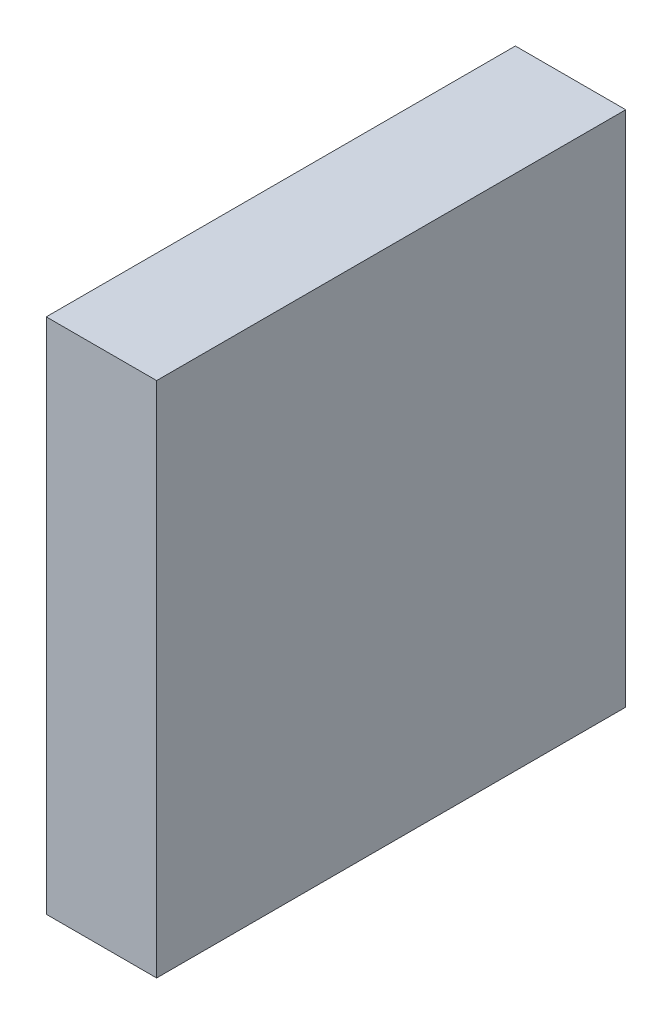
ISO-10303-21;
HEADER;
FILE_DESCRIPTION(('STEP AP214'),'2;1');
FILE_NAME('part.step','',(''),(''),'','','');
FILE_SCHEMA(('AUTOMOTIVE_DESIGN { 1 0 10303 214 1 1 1 1 }'));
ENDSEC;
DATA;
#1=APPLICATION_CONTEXT('core data for automotive mechanical design processes');
#2=APPLICATION_PROTOCOL_DEFINITION('international standard','automotive_design',2000,#1);
#3=PRODUCT_CONTEXT('',#1,'mechanical');
#4=PRODUCT('Part','Part','',(#3));
#5=PRODUCT_RELATED_PRODUCT_CATEGORY('part','',(#4));
#6=PRODUCT_DEFINITION_FORMATION('','',#4);
#7=PRODUCT_DEFINITION_CONTEXT('part definition',#1,'design');
#8=PRODUCT_DEFINITION('design','',#6,#7);
#9=PRODUCT_DEFINITION_SHAPE('','',#8);
#10=(LENGTH_UNIT() NAMED_UNIT(*) SI_UNIT(.MILLI.,.METRE.));
#11=(NAMED_UNIT(*) PLANE_ANGLE_UNIT() SI_UNIT($,.RADIAN.));
#12=(NAMED_UNIT(*) SI_UNIT($,.STERADIAN.) SOLID_ANGLE_UNIT());
#13=UNCERTAINTY_MEASURE_WITH_UNIT(LENGTH_MEASURE(1.E-05),#10,'distance_accuracy_value','');
#14=(GEOMETRIC_REPRESENTATION_CONTEXT(3) GLOBAL_UNCERTAINTY_ASSIGNED_CONTEXT((#13)) GLOBAL_UNIT_ASSIGNED_CONTEXT((#10,
#11,#12)) REPRESENTATION_CONTEXT('',''));
#15=CARTESIAN_POINT('',(0.,0.,0.));
#16=DIRECTION('',(0.,0.,1.));
#17=DIRECTION('',(1.,0.,0.));
#18=AXIS2_PLACEMENT_3D('',#15,#16,#17);
#19=CARTESIAN_POINT('',(7.99999999999999,37.5,68.));
#20=DIRECTION('',(-1.,0.,0.));
#21=DIRECTION('',(0.,-1.,0.));
#22=AXIS2_PLACEMENT_3D('',#19,#20,#21);
#23=PLANE('',#22);
#24=DIRECTION('',(0.,1.,0.));
#25=VECTOR('',#24,1.);
#26=CARTESIAN_POINT('',(7.99999999999999,37.5,0.));
#27=LINE('',#26,#25);
#28=CARTESIAN_POINT('',(8.,-37.5,0.));
#29=VERTEX_POINT('',#28);
#30=CARTESIAN_POINT('',(7.99999999999999,37.5,0.));
#31=VERTEX_POINT('',#30);
#32=EDGE_CURVE('E107',#29,#31,#27,.T.);
#33=ORIENTED_EDGE('',*,*,#32,.T.);
#34=DIRECTION('',(0.,0.,-1.));
#35=VECTOR('',#34,1.);
#36=CARTESIAN_POINT('',(7.99999999999999,37.5,68.));
#37=LINE('',#36,#35);
#38=CARTESIAN_POINT('',(7.99999999999999,37.5,68.));
#39=VERTEX_POINT('',#38);
#40=EDGE_CURVE('E11',#39,#31,#37,.T.);
#41=ORIENTED_EDGE('',*,*,#40,.F.);
#42=DIRECTION('',(0.,1.,0.));
#43=VECTOR('',#42,1.);
#44=CARTESIAN_POINT('',(7.99999999999999,37.5,68.));
#45=LINE('',#44,#43);
#46=CARTESIAN_POINT('',(8.,-37.5,68.));
#47=VERTEX_POINT('',#46);
#48=EDGE_CURVE('E91',#47,#39,#45,.T.);
#49=ORIENTED_EDGE('',*,*,#48,.F.);
#50=DIRECTION('',(0.,0.,-1.));
#51=VECTOR('',#50,1.);
#52=CARTESIAN_POINT('',(8.,-37.5,68.));
#53=LINE('',#52,#51);
#54=EDGE_CURVE('E103',#47,#29,#53,.T.);
#55=ORIENTED_EDGE('',*,*,#54,.T.);
#56=EDGE_LOOP('',(#33,#41,#49,#55));
#57=FACE_BOUND('',#56,.T.);
#58=ADVANCED_FACE('F39',(#57),#23,.F.);
#59=CARTESIAN_POINT('',(-8.00000000000001,37.5,68.));
#60=DIRECTION('',(0.,-1.,0.));
#61=DIRECTION('',(0.,0.,-1.));
#62=AXIS2_PLACEMENT_3D('',#59,#60,#61);
#63=PLANE('',#62);
#64=DIRECTION('',(-1.,0.,0.));
#65=VECTOR('',#64,1.);
#66=CARTESIAN_POINT('',(-8.00000000000001,37.5,0.));
#67=LINE('',#66,#65);
#68=CARTESIAN_POINT('',(-8.00000000000001,37.5,0.));
#69=VERTEX_POINT('',#68);
#70=EDGE_CURVE('E96',#31,#69,#67,.T.);
#71=ORIENTED_EDGE('',*,*,#70,.T.);
#72=DIRECTION('',(0.,0.,-1.));
#73=VECTOR('',#72,1.);
#74=CARTESIAN_POINT('',(-8.00000000000001,37.5,68.));
#75=LINE('',#74,#73);
#76=CARTESIAN_POINT('',(-8.00000000000001,37.5,68.));
#77=VERTEX_POINT('',#76);
#78=EDGE_CURVE('E48',#77,#69,#75,.T.);
#79=ORIENTED_EDGE('',*,*,#78,.F.);
#80=DIRECTION('',(-1.,0.,0.));
#81=VECTOR('',#80,1.);
#82=CARTESIAN_POINT('',(-8.00000000000001,37.5,68.));
#83=LINE('',#82,#81);
#84=EDGE_CURVE('E86',#39,#77,#83,.T.);
#85=ORIENTED_EDGE('',*,*,#84,.F.);
#86=ORIENTED_EDGE('',*,*,#40,.T.);
#87=EDGE_LOOP('',(#71,#79,#85,#86));
#88=FACE_BOUND('',#87,.T.);
#89=ADVANCED_FACE('F95',(#88),#63,.F.);
#90=CARTESIAN_POINT('',(-8.00000000000001,37.5,68.));
#91=DIRECTION('',(1.,0.,0.));
#92=DIRECTION('',(0.,1.,0.));
#93=AXIS2_PLACEMENT_3D('',#90,#91,#92);
#94=PLANE('',#93);
#95=DIRECTION('',(0.,-1.,0.));
#96=VECTOR('',#95,1.);
#97=CARTESIAN_POINT('',(-8.00000000000001,37.5,0.));
#98=LINE('',#97,#96);
#99=CARTESIAN_POINT('',(-8.,-37.5,0.));
#100=VERTEX_POINT('',#99);
#101=EDGE_CURVE('E73',#69,#100,#98,.T.);
#102=ORIENTED_EDGE('',*,*,#101,.T.);
#103=DIRECTION('',(0.,0.,-1.));
#104=VECTOR('',#103,1.);
#105=CARTESIAN_POINT('',(-8.,-37.5,68.));
#106=LINE('',#105,#104);
#107=CARTESIAN_POINT('',(-8.,-37.5,68.));
#108=VERTEX_POINT('',#107);
#109=EDGE_CURVE('E98',#108,#100,#106,.T.);
#110=ORIENTED_EDGE('',*,*,#109,.F.);
#111=DIRECTION('',(0.,-1.,0.));
#112=VECTOR('',#111,1.);
#113=CARTESIAN_POINT('',(-8.00000000000001,37.5,68.));
#114=LINE('',#113,#112);
#115=EDGE_CURVE('E89',#77,#108,#114,.T.);
#116=ORIENTED_EDGE('',*,*,#115,.F.);
#117=ORIENTED_EDGE('',*,*,#78,.T.);
#118=EDGE_LOOP('',(#102,#110,#116,#117));
#119=FACE_BOUND('',#118,.T.);
#120=ADVANCED_FACE('F99',(#119),#94,.F.);
#121=CARTESIAN_POINT('',(-8.,-37.5,68.));
#122=DIRECTION('',(0.,1.,0.));
#123=DIRECTION('',(0.,0.,1.));
#124=AXIS2_PLACEMENT_3D('',#121,#122,#123);
#125=PLANE('',#124);
#126=DIRECTION('',(1.,0.,0.));
#127=VECTOR('',#126,1.);
#128=CARTESIAN_POINT('',(-8.,-37.5,0.));
#129=LINE('',#128,#127);
#130=EDGE_CURVE('E79',#100,#29,#129,.T.);
#131=ORIENTED_EDGE('',*,*,#130,.T.);
#132=ORIENTED_EDGE('',*,*,#54,.F.);
#133=DIRECTION('',(1.,0.,0.));
#134=VECTOR('',#133,1.);
#135=CARTESIAN_POINT('',(-8.,-37.5,68.));
#136=LINE('',#135,#134);
#137=EDGE_CURVE('E56',#108,#47,#136,.T.);
#138=ORIENTED_EDGE('',*,*,#137,.F.);
#139=ORIENTED_EDGE('',*,*,#109,.T.);
#140=EDGE_LOOP('',(#131,#132,#138,#139));
#141=FACE_BOUND('',#140,.T.);
#142=ADVANCED_FACE('F120',(#141),#125,.F.);
#143=CARTESIAN_POINT('',(0.,0.,68.));
#144=DIRECTION('',(0.,0.,1.));
#145=DIRECTION('',(1.,0.,0.));
#146=AXIS2_PLACEMENT_3D('',#143,#144,#145);
#147=PLANE('',#146);
#148=ORIENTED_EDGE('',*,*,#48,.T.);
#149=ORIENTED_EDGE('',*,*,#84,.T.);
#150=ORIENTED_EDGE('',*,*,#115,.T.);
#151=ORIENTED_EDGE('',*,*,#137,.T.);
#152=EDGE_LOOP('',(#148,#149,#150,#151));
#153=FACE_BOUND('',#152,.T.);
#154=ADVANCED_FACE('F87',(#153),#147,.T.);
#155=CARTESIAN_POINT('',(0.,0.,0.));
#156=DIRECTION('',(0.,0.,1.));
#157=DIRECTION('',(1.,0.,0.));
#158=AXIS2_PLACEMENT_3D('',#155,#156,#157);
#159=PLANE('',#158);
#160=ORIENTED_EDGE('',*,*,#32,.F.);
#161=ORIENTED_EDGE('',*,*,#130,.F.);
#162=ORIENTED_EDGE('',*,*,#101,.F.);
#163=ORIENTED_EDGE('',*,*,#70,.F.);
#164=EDGE_LOOP('',(#160,#161,#162,#163));
#165=FACE_BOUND('',#164,.T.);
#166=ADVANCED_FACE('F123',(#165),#159,.F.);
#167=CLOSED_SHELL('',(#58,#89,#120,#142,#154,#166));
#168=MANIFOLD_SOLID_BREP('B2',#167);
#169=ADVANCED_BREP_SHAPE_REPRESENTATION('',(#18,#168),#14);
#170=SHAPE_DEFINITION_REPRESENTATION(#9,#169);
ENDSEC;
END-ISO-10303-21;
